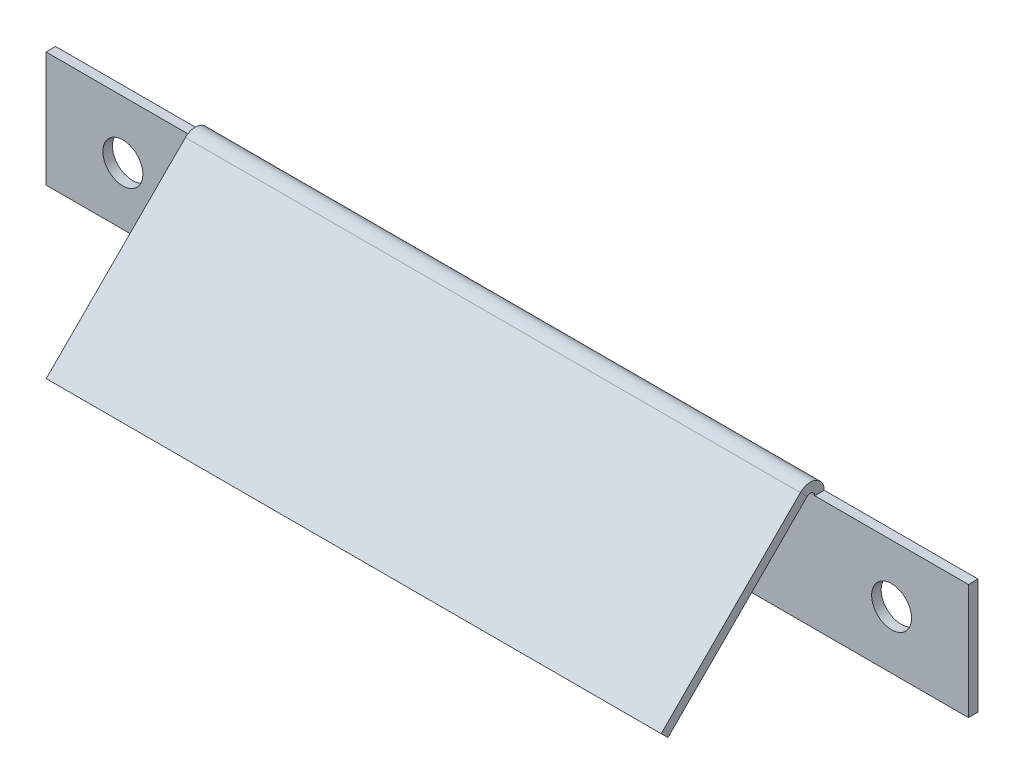
ISO-10303-21;
HEADER;
FILE_DESCRIPTION(('STEP AP214'),'2;1');
FILE_NAME('part.step','',(''),(''),'','','');
FILE_SCHEMA(('AUTOMOTIVE_DESIGN { 1 0 10303 214 1 1 1 1 }'));
ENDSEC;
DATA;
#1=APPLICATION_CONTEXT('core data for automotive mechanical design processes');
#2=APPLICATION_PROTOCOL_DEFINITION('international standard','automotive_design',2000,#1);
#3=PRODUCT_CONTEXT('',#1,'mechanical');
#4=PRODUCT('Part','Part','',(#3));
#5=PRODUCT_RELATED_PRODUCT_CATEGORY('part','',(#4));
#6=PRODUCT_DEFINITION_FORMATION('','',#4);
#7=PRODUCT_DEFINITION_CONTEXT('part definition',#1,'design');
#8=PRODUCT_DEFINITION('design','',#6,#7);
#9=PRODUCT_DEFINITION_SHAPE('','',#8);
#10=(LENGTH_UNIT() NAMED_UNIT(*) SI_UNIT(.MILLI.,.METRE.));
#11=(NAMED_UNIT(*) PLANE_ANGLE_UNIT() SI_UNIT($,.RADIAN.));
#12=(NAMED_UNIT(*) SI_UNIT($,.STERADIAN.) SOLID_ANGLE_UNIT());
#13=UNCERTAINTY_MEASURE_WITH_UNIT(LENGTH_MEASURE(1.E-05),#10,'distance_accuracy_value','');
#14=(GEOMETRIC_REPRESENTATION_CONTEXT(3) GLOBAL_UNCERTAINTY_ASSIGNED_CONTEXT((#13)) GLOBAL_UNIT_ASSIGNED_CONTEXT((#10,
#11,#12)) REPRESENTATION_CONTEXT('',''));
#15=CARTESIAN_POINT('',(0.,0.,0.));
#16=DIRECTION('',(0.,0.,1.));
#17=DIRECTION('',(1.,0.,0.));
#18=AXIS2_PLACEMENT_3D('',#15,#16,#17);
#19=CARTESIAN_POINT('',(-76.2,9.525,-1.5748));
#20=DIRECTION('',(0.,1.,0.));
#21=DIRECTION('',(0.,0.,1.));
#22=AXIS2_PLACEMENT_3D('',#19,#20,#21);
#23=PLANE('',#22);
#24=DIRECTION('',(-1.,0.,0.));
#25=VECTOR('',#24,1.);
#26=CARTESIAN_POINT('',(-76.2,9.525,0.));
#27=LINE('',#26,#25);
#28=CARTESIAN_POINT('',(-50.8,9.525,0.));
#29=VERTEX_POINT('',#28);
#30=CARTESIAN_POINT('',(-76.2,9.525,0.));
#31=VERTEX_POINT('',#30);
#32=EDGE_CURVE('E253',#29,#31,#27,.T.);
#33=ORIENTED_EDGE('',*,*,#32,.F.);
#34=DIRECTION('',(0.,0.,-1.));
#35=VECTOR('',#34,1.);
#36=CARTESIAN_POINT('',(-50.8,9.525,0.));
#37=LINE('',#36,#35);
#38=CARTESIAN_POINT('',(-50.8,9.525,-1.5748));
#39=VERTEX_POINT('',#38);
#40=EDGE_CURVE('E206',#29,#39,#37,.T.);
#41=ORIENTED_EDGE('',*,*,#40,.T.);
#42=DIRECTION('',(-1.,0.,0.));
#43=VECTOR('',#42,1.);
#44=CARTESIAN_POINT('',(-76.2,9.525,-1.5748));
#45=LINE('',#44,#43);
#46=CARTESIAN_POINT('',(-76.2,9.525,-1.5748));
#47=VERTEX_POINT('',#46);
#48=EDGE_CURVE('E284',#39,#47,#45,.T.);
#49=ORIENTED_EDGE('',*,*,#48,.T.);
#50=DIRECTION('',(0.,0.,1.));
#51=VECTOR('',#50,1.);
#52=CARTESIAN_POINT('',(-76.2,9.525,-1.5748));
#53=LINE('',#52,#51);
#54=EDGE_CURVE('E270',#47,#31,#53,.T.);
#55=ORIENTED_EDGE('',*,*,#54,.T.);
#56=EDGE_LOOP('',(#33,#41,#49,#55));
#57=FACE_BOUND('',#56,.T.);
#58=ADVANCED_FACE('F70',(#57),#23,.T.);
#59=CARTESIAN_POINT('',(76.2,9.525,-1.5748));
#60=DIRECTION('',(1.,0.,0.));
#61=DIRECTION('',(0.,0.,-1.));
#62=AXIS2_PLACEMENT_3D('',#59,#60,#61);
#63=PLANE('',#62);
#64=DIRECTION('',(0.,1.,0.));
#65=VECTOR('',#64,1.);
#66=CARTESIAN_POINT('',(76.2,9.525,0.));
#67=LINE('',#66,#65);
#68=CARTESIAN_POINT('',(76.2,-9.525,0.));
#69=VERTEX_POINT('',#68);
#70=CARTESIAN_POINT('',(76.2,9.525,0.));
#71=VERTEX_POINT('',#70);
#72=EDGE_CURVE('E205',#69,#71,#67,.T.);
#73=ORIENTED_EDGE('',*,*,#72,.F.);
#74=DIRECTION('',(0.,0.,1.));
#75=VECTOR('',#74,1.);
#76=CARTESIAN_POINT('',(76.2,-9.525,-1.5748));
#77=LINE('',#76,#75);
#78=CARTESIAN_POINT('',(76.2,-9.525,-1.5748));
#79=VERTEX_POINT('',#78);
#80=EDGE_CURVE('E15',#79,#69,#77,.T.);
#81=ORIENTED_EDGE('',*,*,#80,.F.);
#82=DIRECTION('',(0.,1.,0.));
#83=VECTOR('',#82,1.);
#84=CARTESIAN_POINT('',(76.2,9.525,-1.5748));
#85=LINE('',#84,#83);
#86=CARTESIAN_POINT('',(76.2,9.525,-1.5748));
#87=VERTEX_POINT('',#86);
#88=EDGE_CURVE('E268',#79,#87,#85,.T.);
#89=ORIENTED_EDGE('',*,*,#88,.T.);
#90=DIRECTION('',(0.,0.,1.));
#91=VECTOR('',#90,1.);
#92=CARTESIAN_POINT('',(76.2,9.525,-1.5748));
#93=LINE('',#92,#91);
#94=EDGE_CURVE('E120',#87,#71,#93,.T.);
#95=ORIENTED_EDGE('',*,*,#94,.T.);
#96=EDGE_LOOP('',(#73,#81,#89,#95));
#97=FACE_BOUND('',#96,.T.);
#98=ADVANCED_FACE('F72',(#97),#63,.T.);
#99=CARTESIAN_POINT('',(-76.2,-9.525,-1.5748));
#100=DIRECTION('',(0.,-1.,0.));
#101=DIRECTION('',(0.,0.,-1.));
#102=AXIS2_PLACEMENT_3D('',#99,#100,#101);
#103=PLANE('',#102);
#104=DIRECTION('',(1.,0.,0.));
#105=VECTOR('',#104,1.);
#106=CARTESIAN_POINT('',(-76.2,-9.525,0.));
#107=LINE('',#106,#105);
#108=CARTESIAN_POINT('',(-76.2,-9.525,0.));
#109=VERTEX_POINT('',#108);
#110=EDGE_CURVE('E256',#109,#69,#107,.T.);
#111=ORIENTED_EDGE('',*,*,#110,.F.);
#112=DIRECTION('',(0.,0.,1.));
#113=VECTOR('',#112,1.);
#114=CARTESIAN_POINT('',(-76.2,-9.525,-1.5748));
#115=LINE('',#114,#113);
#116=CARTESIAN_POINT('',(-76.2,-9.525,-1.5748));
#117=VERTEX_POINT('',#116);
#118=EDGE_CURVE('E79',#117,#109,#115,.T.);
#119=ORIENTED_EDGE('',*,*,#118,.F.);
#120=DIRECTION('',(1.,0.,0.));
#121=VECTOR('',#120,1.);
#122=CARTESIAN_POINT('',(-76.2,-9.525,-1.5748));
#123=LINE('',#122,#121);
#124=EDGE_CURVE('E275',#117,#79,#123,.T.);
#125=ORIENTED_EDGE('',*,*,#124,.T.);
#126=ORIENTED_EDGE('',*,*,#80,.T.);
#127=EDGE_LOOP('',(#111,#119,#125,#126));
#128=FACE_BOUND('',#127,.T.);
#129=ADVANCED_FACE('F289',(#128),#103,.T.);
#130=CARTESIAN_POINT('',(-76.2,9.525,-1.5748));
#131=DIRECTION('',(-1.,0.,0.));
#132=DIRECTION('',(0.,0.,1.));
#133=AXIS2_PLACEMENT_3D('',#130,#131,#132);
#134=PLANE('',#133);
#135=DIRECTION('',(0.,-1.,0.));
#136=VECTOR('',#135,1.);
#137=CARTESIAN_POINT('',(-76.2,9.525,0.));
#138=LINE('',#137,#136);
#139=EDGE_CURVE('E252',#31,#109,#138,.T.);
#140=ORIENTED_EDGE('',*,*,#139,.F.);
#141=ORIENTED_EDGE('',*,*,#54,.F.);
#142=DIRECTION('',(0.,-1.,0.));
#143=VECTOR('',#142,1.);
#144=CARTESIAN_POINT('',(-76.2,9.525,-1.5748));
#145=LINE('',#144,#143);
#146=EDGE_CURVE('E276',#47,#117,#145,.T.);
#147=ORIENTED_EDGE('',*,*,#146,.T.);
#148=ORIENTED_EDGE('',*,*,#118,.T.);
#149=EDGE_LOOP('',(#140,#141,#147,#148));
#150=FACE_BOUND('',#149,.T.);
#151=ADVANCED_FACE('F288',(#150),#134,.T.);
#152=DIRECTION('',(0.,0.,-1.));
#153=VECTOR('',#152,1.);
#154=CARTESIAN_POINT('',(50.8,9.525,0.));
#155=LINE('',#154,#153);
#156=CARTESIAN_POINT('',(50.8,9.525,0.));
#157=VERTEX_POINT('',#156);
#158=CARTESIAN_POINT('',(50.8,9.525,-1.5748));
#159=VERTEX_POINT('',#158);
#160=EDGE_CURVE('E202',#157,#159,#155,.T.);
#161=ORIENTED_EDGE('',*,*,#160,.F.);
#162=EDGE_CURVE('E247',#71,#157,#27,.T.);
#163=ORIENTED_EDGE('',*,*,#162,.F.);
#164=ORIENTED_EDGE('',*,*,#94,.F.);
#165=EDGE_CURVE('E249',#87,#159,#45,.T.);
#166=ORIENTED_EDGE('',*,*,#165,.T.);
#167=EDGE_LOOP('',(#161,#163,#164,#166));
#168=FACE_BOUND('',#167,.T.);
#169=ADVANCED_FACE('F246',(#168),#23,.T.);
#170=CARTESIAN_POINT('',(0.,0.,-1.5748));
#171=DIRECTION('',(0.,0.,1.));
#172=DIRECTION('',(1.,0.,0.));
#173=AXIS2_PLACEMENT_3D('',#170,#171,#172);
#174=PLANE('',#173);
#175=CARTESIAN_POINT('',(-63.5,0.,-1.5748));
#176=DIRECTION('',(0.,0.,1.));
#177=DIRECTION('',(1.,0.,0.));
#178=AXIS2_PLACEMENT_3D('',#175,#176,#177);
#179=CIRCLE('',#178,3.3);
#180=CARTESIAN_POINT('',(-60.2,0.,-1.5748));
#181=VERTEX_POINT('',#180);
#182=EDGE_CURVE('E354',#181,#181,#179,.T.);
#183=ORIENTED_EDGE('',*,*,#182,.T.);
#184=EDGE_LOOP('',(#183));
#185=FACE_BOUND('',#184,.T.);
#186=CARTESIAN_POINT('',(63.5,0.,-1.5748));
#187=DIRECTION('',(0.,0.,1.));
#188=DIRECTION('',(1.,0.,0.));
#189=AXIS2_PLACEMENT_3D('',#186,#187,#188);
#190=CIRCLE('',#189,3.3);
#191=CARTESIAN_POINT('',(66.8,0.,-1.5748));
#192=VERTEX_POINT('',#191);
#193=EDGE_CURVE('E196',#192,#192,#190,.T.);
#194=ORIENTED_EDGE('',*,*,#193,.T.);
#195=EDGE_LOOP('',(#194));
#196=FACE_BOUND('',#195,.T.);
#197=ORIENTED_EDGE('',*,*,#88,.F.);
#198=ORIENTED_EDGE('',*,*,#124,.F.);
#199=ORIENTED_EDGE('',*,*,#146,.F.);
#200=ORIENTED_EDGE('',*,*,#48,.F.);
#201=DIRECTION('',(-1.,0.,0.));
#202=VECTOR('',#201,1.);
#203=CARTESIAN_POINT('',(-50.8,9.525,-1.57480000000001));
#204=LINE('',#203,#202);
#205=EDGE_CURVE('E216',#39,#159,#204,.F.);
#206=ORIENTED_EDGE('',*,*,#205,.T.);
#207=ORIENTED_EDGE('',*,*,#165,.F.);
#208=EDGE_LOOP('',(#197,#198,#199,#200,#206,#207));
#209=FACE_BOUND('',#208,.T.);
#210=ADVANCED_FACE('F285',(#185,#196,#209),#174,.F.);
#211=CARTESIAN_POINT('',(0.,0.,0.));
#212=DIRECTION('',(0.,0.,1.));
#213=DIRECTION('',(1.,0.,0.));
#214=AXIS2_PLACEMENT_3D('',#211,#212,#213);
#215=PLANE('',#214);
#216=CARTESIAN_POINT('',(-63.5,0.,0.));
#217=DIRECTION('',(0.,0.,1.));
#218=DIRECTION('',(1.,0.,0.));
#219=AXIS2_PLACEMENT_3D('',#216,#217,#218);
#220=CIRCLE('',#219,3.3);
#221=CARTESIAN_POINT('',(-60.2,0.,0.));
#222=VERTEX_POINT('',#221);
#223=EDGE_CURVE('E352',#222,#222,#220,.T.);
#224=ORIENTED_EDGE('',*,*,#223,.F.);
#225=EDGE_LOOP('',(#224));
#226=FACE_BOUND('',#225,.T.);
#227=CARTESIAN_POINT('',(63.5,0.,0.));
#228=DIRECTION('',(0.,0.,1.));
#229=DIRECTION('',(1.,0.,0.));
#230=AXIS2_PLACEMENT_3D('',#227,#228,#229);
#231=CIRCLE('',#230,3.3);
#232=CARTESIAN_POINT('',(66.8,0.,0.));
#233=VERTEX_POINT('',#232);
#234=EDGE_CURVE('E355',#233,#233,#231,.T.);
#235=ORIENTED_EDGE('',*,*,#234,.F.);
#236=EDGE_LOOP('',(#235));
#237=FACE_BOUND('',#236,.T.);
#238=ORIENTED_EDGE('',*,*,#72,.T.);
#239=ORIENTED_EDGE('',*,*,#162,.T.);
#240=DIRECTION('',(-1.,0.,0.));
#241=VECTOR('',#240,1.);
#242=CARTESIAN_POINT('',(-50.8,9.525,0.));
#243=LINE('',#242,#241);
#244=EDGE_CURVE('E212',#29,#157,#243,.F.);
#245=ORIENTED_EDGE('',*,*,#244,.F.);
#246=ORIENTED_EDGE('',*,*,#32,.T.);
#247=ORIENTED_EDGE('',*,*,#139,.T.);
#248=ORIENTED_EDGE('',*,*,#110,.T.);
#249=EDGE_LOOP('',(#238,#239,#245,#246,#247,#248));
#250=FACE_BOUND('',#249,.T.);
#251=ADVANCED_FACE('F250',(#226,#237,#250),#215,.T.);
#252=CARTESIAN_POINT('',(50.8,9.525,0.736600000000002));
#253=DIRECTION('',(1.,0.,0.));
#254=DIRECTION('',(0.,0.,-1.));
#255=AXIS2_PLACEMENT_3D('',#252,#253,#254);
#256=PLANE('',#255);
#257=DIRECTION('',(0.,-0.707106781186549,-0.707106781186546));
#258=VECTOR('',#257,1.);
#259=CARTESIAN_POINT('',(50.8,11.1594066140346,2.37100661403458));
#260=LINE('',#259,#258);
#261=CARTESIAN_POINT('',(50.8,10.045854855022,1.25745485502201));
#262=VERTEX_POINT('',#261);
#263=CARTESIAN_POINT('',(50.8,11.1594066140346,2.37100661403459));
#264=VERTEX_POINT('',#263);
#265=EDGE_CURVE('E180',#262,#264,#260,.F.);
#266=ORIENTED_EDGE('',*,*,#265,.F.);
#267=CARTESIAN_POINT('',(50.8,9.525,0.736600000000002));
#268=DIRECTION('',(-1.,0.,0.));
#269=DIRECTION('',(0.,0.,1.));
#270=AXIS2_PLACEMENT_3D('',#267,#268,#269);
#271=CIRCLE('',#270,0.736600000000001);
#272=EDGE_CURVE('E209',#157,#262,#271,.F.);
#273=ORIENTED_EDGE('',*,*,#272,.F.);
#274=ORIENTED_EDGE('',*,*,#160,.T.);
#275=CARTESIAN_POINT('',(50.8,9.525,0.736600000000002));
#276=DIRECTION('',(-1.,0.,0.));
#277=DIRECTION('',(0.,0.,1.));
#278=AXIS2_PLACEMENT_3D('',#275,#276,#277);
#279=CIRCLE('',#278,2.3114);
#280=EDGE_CURVE('E214',#159,#264,#279,.F.);
#281=ORIENTED_EDGE('',*,*,#280,.T.);
#282=EDGE_LOOP('',(#266,#273,#274,#281));
#283=FACE_BOUND('',#282,.T.);
#284=ADVANCED_FACE('F245',(#283),#256,.T.);
#285=CARTESIAN_POINT('',(-50.8,9.525,0.736599999999988));
#286=DIRECTION('',(1.,0.,0.));
#287=DIRECTION('',(0.,0.,-1.));
#288=AXIS2_PLACEMENT_3D('',#285,#286,#287);
#289=PLANE('',#288);
#290=CARTESIAN_POINT('',(-50.8,9.525,0.736599999999988));
#291=DIRECTION('',(-1.,0.,0.));
#292=DIRECTION('',(0.,0.,1.));
#293=AXIS2_PLACEMENT_3D('',#290,#291,#292);
#294=CIRCLE('',#293,0.736600000000001);
#295=CARTESIAN_POINT('',(-50.8,10.045854855022,1.257454855022));
#296=VERTEX_POINT('',#295);
#297=EDGE_CURVE('E231',#296,#29,#294,.T.);
#298=ORIENTED_EDGE('',*,*,#297,.F.);
#299=DIRECTION('',(0.,-0.707106781186549,-0.707106781186546));
#300=VECTOR('',#299,1.);
#301=CARTESIAN_POINT('',(-50.8,10.045854855022,1.25745485502201));
#302=LINE('',#301,#300);
#303=CARTESIAN_POINT('',(-50.8,11.1594066140346,2.37100661403458));
#304=VERTEX_POINT('',#303);
#305=EDGE_CURVE('E191',#296,#304,#302,.F.);
#306=ORIENTED_EDGE('',*,*,#305,.T.);
#307=CARTESIAN_POINT('',(-50.8,9.525,0.736599999999988));
#308=DIRECTION('',(-1.,0.,0.));
#309=DIRECTION('',(0.,0.,1.));
#310=AXIS2_PLACEMENT_3D('',#307,#308,#309);
#311=CIRCLE('',#310,2.3114);
#312=EDGE_CURVE('E87',#304,#39,#311,.T.);
#313=ORIENTED_EDGE('',*,*,#312,.T.);
#314=ORIENTED_EDGE('',*,*,#40,.F.);
#315=EDGE_LOOP('',(#298,#306,#313,#314));
#316=FACE_BOUND('',#315,.T.);
#317=ADVANCED_FACE('F315',(#316),#289,.F.);
#318=CARTESIAN_POINT('',(-50.8,9.525,0.736599999999988));
#319=DIRECTION('',(-1.,0.,0.));
#320=DIRECTION('',(0.,0.707106781186549,0.707106781186546));
#321=AXIS2_PLACEMENT_3D('',#318,#319,#320);
#322=CYLINDRICAL_SURFACE('',#321,2.3114);
#323=ORIENTED_EDGE('',*,*,#205,.F.);
#324=ORIENTED_EDGE('',*,*,#312,.F.);
#325=DIRECTION('',(-1.,0.,0.));
#326=VECTOR('',#325,1.);
#327=CARTESIAN_POINT('',(50.8,11.1594066140346,2.37100661403458));
#328=LINE('',#327,#326);
#329=EDGE_CURVE('E189',#304,#264,#328,.F.);
#330=ORIENTED_EDGE('',*,*,#329,.T.);
#331=ORIENTED_EDGE('',*,*,#280,.F.);
#332=EDGE_LOOP('',(#323,#324,#330,#331));
#333=FACE_BOUND('',#332,.T.);
#334=ADVANCED_FACE('F318',(#333),#322,.T.);
#335=CARTESIAN_POINT('',(-50.8,9.525,0.736599999999988));
#336=DIRECTION('',(-1.,0.,0.));
#337=DIRECTION('',(0.,0.707106781186549,0.707106781186546));
#338=AXIS2_PLACEMENT_3D('',#335,#336,#337);
#339=CYLINDRICAL_SURFACE('',#338,0.736600000000001);
#340=ORIENTED_EDGE('',*,*,#244,.T.);
#341=ORIENTED_EDGE('',*,*,#272,.T.);
#342=DIRECTION('',(-1.,0.,0.));
#343=VECTOR('',#342,1.);
#344=CARTESIAN_POINT('',(50.8,10.045854855022,1.25745485502201));
#345=LINE('',#344,#343);
#346=EDGE_CURVE('E193',#262,#296,#345,.T.);
#347=ORIENTED_EDGE('',*,*,#346,.T.);
#348=ORIENTED_EDGE('',*,*,#297,.T.);
#349=EDGE_LOOP('',(#340,#341,#347,#348));
#350=FACE_BOUND('',#349,.T.);
#351=ADVANCED_FACE('F238',(#350),#339,.F.);
#352=CARTESIAN_POINT('',(50.8,12.4168614690566,1.11355175901257));
#353=DIRECTION('',(-1.,0.,0.));
#354=DIRECTION('',(0.,0.,1.));
#355=AXIS2_PLACEMENT_3D('',#352,#353,#354);
#356=PLANE('',#355);
#357=ORIENTED_EDGE('',*,*,#265,.T.);
#358=DIRECTION('',(0.,0.707106781186546,-0.707106781186549));
#359=VECTOR('',#358,1.);
#360=CARTESIAN_POINT('',(50.8,7.65436146905661,5.87605175901258));
#361=LINE('',#360,#359);
#362=CARTESIAN_POINT('',(50.8,-11.8355551351383,25.3659683632075));
#363=VERTEX_POINT('',#362);
#364=EDGE_CURVE('E161',#363,#264,#361,.T.);
#365=ORIENTED_EDGE('',*,*,#364,.F.);
#366=DIRECTION('',(0.,-0.707106781186549,-0.707106781186546));
#367=VECTOR('',#366,1.);
#368=CARTESIAN_POINT('',(50.8,-11.8355551351383,25.3659683632075));
#369=LINE('',#368,#367);
#370=CARTESIAN_POINT('',(50.8,-12.9491068941508,24.2524166041949));
#371=VERTEX_POINT('',#370);
#372=EDGE_CURVE('E167',#363,#371,#369,.T.);
#373=ORIENTED_EDGE('',*,*,#372,.T.);
#374=DIRECTION('',(0.,-0.707106781186546,0.707106781186549));
#375=VECTOR('',#374,1.);
#376=CARTESIAN_POINT('',(50.8,11.303309710044,0.));
#377=LINE('',#376,#375);
#378=EDGE_CURVE('E187',#371,#262,#377,.F.);
#379=ORIENTED_EDGE('',*,*,#378,.T.);
#380=EDGE_LOOP('',(#357,#365,#373,#379));
#381=FACE_BOUND('',#380,.T.);
#382=ADVANCED_FACE('F179',(#381),#356,.F.);
#383=CARTESIAN_POINT('',(-50.8,-11.8355551351383,25.3659683632075));
#384=DIRECTION('',(1.,0.,0.));
#385=DIRECTION('',(0.,0.,-1.));
#386=AXIS2_PLACEMENT_3D('',#383,#384,#385);
#387=PLANE('',#386);
#388=ORIENTED_EDGE('',*,*,#305,.F.);
#389=DIRECTION('',(0.,0.707106781186546,-0.707106781186549));
#390=VECTOR('',#389,1.);
#391=CARTESIAN_POINT('',(-50.8,-12.9491068941508,24.2524166041949));
#392=LINE('',#391,#390);
#393=CARTESIAN_POINT('',(-50.8,-12.9491068941508,24.2524166041949));
#394=VERTEX_POINT('',#393);
#395=EDGE_CURVE('E183',#296,#394,#392,.F.);
#396=ORIENTED_EDGE('',*,*,#395,.T.);
#397=DIRECTION('',(0.,-0.707106781186549,-0.707106781186546));
#398=VECTOR('',#397,1.);
#399=CARTESIAN_POINT('',(-50.8,-11.8355551351383,25.3659683632075));
#400=LINE('',#399,#398);
#401=CARTESIAN_POINT('',(-50.8,-11.8355551351383,25.3659683632075));
#402=VERTEX_POINT('',#401);
#403=EDGE_CURVE('E176',#402,#394,#400,.T.);
#404=ORIENTED_EDGE('',*,*,#403,.F.);
#405=DIRECTION('',(0.,-0.707106781186546,0.707106781186549));
#406=VECTOR('',#405,1.);
#407=CARTESIAN_POINT('',(-50.8,7.65436146905661,5.87605175901258));
#408=LINE('',#407,#406);
#409=EDGE_CURVE('E163',#304,#402,#408,.T.);
#410=ORIENTED_EDGE('',*,*,#409,.F.);
#411=EDGE_LOOP('',(#388,#396,#404,#410));
#412=FACE_BOUND('',#411,.T.);
#413=ADVANCED_FACE('F328',(#412),#387,.F.);
#414=CARTESIAN_POINT('',(0.,7.65436146905661,5.87605175901258));
#415=DIRECTION('',(0.,-0.707106781186549,-0.707106781186546));
#416=DIRECTION('',(0.,0.707106781186546,-0.707106781186549));
#417=AXIS2_PLACEMENT_3D('',#414,#415,#416);
#418=PLANE('',#417);
#419=ORIENTED_EDGE('',*,*,#329,.F.);
#420=ORIENTED_EDGE('',*,*,#409,.T.);
#421=DIRECTION('',(1.,0.,0.));
#422=VECTOR('',#421,1.);
#423=CARTESIAN_POINT('',(0.,-11.8355551351383,25.3659683632075));
#424=LINE('',#423,#422);
#425=EDGE_CURVE('E156',#402,#363,#424,.T.);
#426=ORIENTED_EDGE('',*,*,#425,.T.);
#427=ORIENTED_EDGE('',*,*,#364,.T.);
#428=EDGE_LOOP('',(#419,#420,#426,#427));
#429=FACE_BOUND('',#428,.T.);
#430=ADVANCED_FACE('F159',(#429),#418,.F.);
#431=CARTESIAN_POINT('',(0.,6.54080971004404,4.7625));
#432=DIRECTION('',(0.,-0.707106781186549,-0.707106781186546));
#433=DIRECTION('',(0.,0.707106781186546,-0.707106781186549));
#434=AXIS2_PLACEMENT_3D('',#431,#432,#433);
#435=PLANE('',#434);
#436=ORIENTED_EDGE('',*,*,#395,.F.);
#437=ORIENTED_EDGE('',*,*,#346,.F.);
#438=ORIENTED_EDGE('',*,*,#378,.F.);
#439=DIRECTION('',(-1.,0.,0.));
#440=VECTOR('',#439,1.);
#441=CARTESIAN_POINT('',(50.8,-12.9491068941508,24.2524166041949));
#442=LINE('',#441,#440);
#443=EDGE_CURVE('E172',#394,#371,#442,.F.);
#444=ORIENTED_EDGE('',*,*,#443,.F.);
#445=EDGE_LOOP('',(#436,#437,#438,#444));
#446=FACE_BOUND('',#445,.T.);
#447=ADVANCED_FACE('F335',(#446),#435,.T.);
#448=CARTESIAN_POINT('',(50.8,-11.8355551351383,25.3659683632075));
#449=DIRECTION('',(0.,0.707106781186546,-0.707106781186549));
#450=DIRECTION('',(0.,0.707106781186549,0.707106781186546));
#451=AXIS2_PLACEMENT_3D('',#448,#449,#450);
#452=PLANE('',#451);
#453=ORIENTED_EDGE('',*,*,#443,.T.);
#454=ORIENTED_EDGE('',*,*,#372,.F.);
#455=ORIENTED_EDGE('',*,*,#425,.F.);
#456=ORIENTED_EDGE('',*,*,#403,.T.);
#457=EDGE_LOOP('',(#453,#454,#455,#456));
#458=FACE_BOUND('',#457,.T.);
#459=ADVANCED_FACE('F170',(#458),#452,.F.);
#460=CARTESIAN_POINT('',(63.5,0.,0.));
#461=DIRECTION('',(0.,0.,1.));
#462=DIRECTION('',(1.,0.,0.));
#463=AXIS2_PLACEMENT_3D('',#460,#461,#462);
#464=CYLINDRICAL_SURFACE('',#463,3.3);
#465=ORIENTED_EDGE('',*,*,#234,.T.);
#466=EDGE_LOOP('',(#465));
#467=FACE_BOUND('',#466,.T.);
#468=ORIENTED_EDGE('',*,*,#193,.F.);
#469=EDGE_LOOP('',(#468));
#470=FACE_BOUND('',#469,.T.);
#471=ADVANCED_FACE('F334',(#467,#470),#464,.F.);
#472=CARTESIAN_POINT('',(-63.5,0.,0.));
#473=DIRECTION('',(0.,0.,1.));
#474=DIRECTION('',(1.,0.,0.));
#475=AXIS2_PLACEMENT_3D('',#472,#473,#474);
#476=CYLINDRICAL_SURFACE('',#475,3.3);
#477=ORIENTED_EDGE('',*,*,#223,.T.);
#478=EDGE_LOOP('',(#477));
#479=FACE_BOUND('',#478,.T.);
#480=ORIENTED_EDGE('',*,*,#182,.F.);
#481=EDGE_LOOP('',(#480));
#482=FACE_BOUND('',#481,.T.);
#483=ADVANCED_FACE('F343',(#479,#482),#476,.F.);
#484=CLOSED_SHELL('',(#58,#98,#129,#151,#169,#210,#251,#284,#317,#334,#351,#382,#413,#430,#447,
#459,#471,#483));
#485=MANIFOLD_SOLID_BREP('B2',#484);
#486=ADVANCED_BREP_SHAPE_REPRESENTATION('',(#18,#485),#14);
#487=SHAPE_DEFINITION_REPRESENTATION(#9,#486);
ENDSEC;
END-ISO-10303-21;
